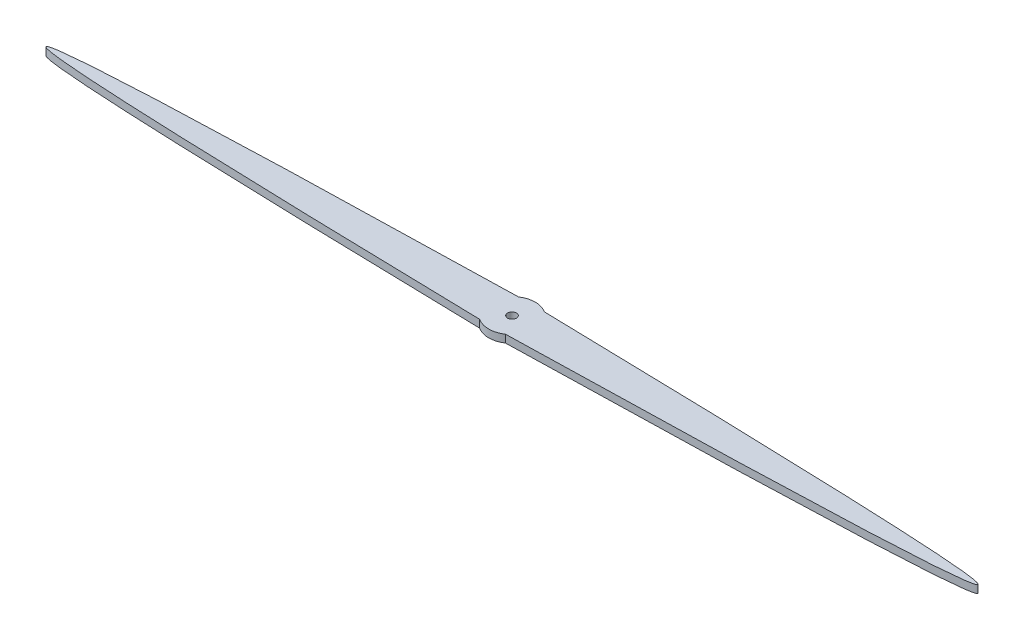
ISO-10303-21;
HEADER;
FILE_DESCRIPTION(('STEP AP214'),'2;1');
FILE_NAME('part.step','',(''),(''),'','','');
FILE_SCHEMA(('AUTOMOTIVE_DESIGN { 1 0 10303 214 1 1 1 1 }'));
ENDSEC;
DATA;
#1=APPLICATION_CONTEXT('core data for automotive mechanical design processes');
#2=APPLICATION_PROTOCOL_DEFINITION('international standard','automotive_design',2000,#1);
#3=PRODUCT_CONTEXT('',#1,'mechanical');
#4=PRODUCT('Part','Part','',(#3));
#5=PRODUCT_RELATED_PRODUCT_CATEGORY('part','',(#4));
#6=PRODUCT_DEFINITION_FORMATION('','',#4);
#7=PRODUCT_DEFINITION_CONTEXT('part definition',#1,'design');
#8=PRODUCT_DEFINITION('design','',#6,#7);
#9=PRODUCT_DEFINITION_SHAPE('','',#8);
#10=(LENGTH_UNIT() NAMED_UNIT(*) SI_UNIT(.MILLI.,.METRE.));
#11=(NAMED_UNIT(*) PLANE_ANGLE_UNIT() SI_UNIT($,.RADIAN.));
#12=(NAMED_UNIT(*) SI_UNIT($,.STERADIAN.) SOLID_ANGLE_UNIT());
#13=UNCERTAINTY_MEASURE_WITH_UNIT(LENGTH_MEASURE(1.E-05),#10,'distance_accuracy_value','');
#14=(GEOMETRIC_REPRESENTATION_CONTEXT(3) GLOBAL_UNCERTAINTY_ASSIGNED_CONTEXT((#13)) GLOBAL_UNIT_ASSIGNED_CONTEXT((#10,
#11,#12)) REPRESENTATION_CONTEXT('',''));
#15=CARTESIAN_POINT('',(0.,0.,0.));
#16=DIRECTION('',(0.,0.,1.));
#17=DIRECTION('',(1.,0.,0.));
#18=AXIS2_PLACEMENT_3D('',#15,#16,#17);
#19=CARTESIAN_POINT('',(152.4,2.5146,0.));
#20=DIRECTION('',(0.,1.,0.));
#21=DIRECTION('',(0.,0.,1.));
#22=AXIS2_PLACEMENT_3D('',#19,#20,#21);
#23=PLANE('',#22);
#24=CARTESIAN_POINT('',(4.21211348375136,2.5146,6.35));
#25=CARTESIAN_POINT('',(300.587886516249,2.5146,0.));
#26=CARTESIAN_POINT('',(4.21211348375136,2.5146,-6.35));
#27=B_SPLINE_CURVE_WITH_KNOTS('',2,(#24,#25,#26),.UNSPECIFIED.,.F.,.F.,(3,3),(0.,1.),.UNSPECIFIED.);
#28=CARTESIAN_POINT('',(4.21211348375136,2.5146,6.35));
#29=VERTEX_POINT('',#28);
#30=CARTESIAN_POINT('',(4.21211348375136,2.5146,-6.35));
#31=VERTEX_POINT('',#30);
#32=EDGE_CURVE('E91',#29,#31,#27,.T.);
#33=ORIENTED_EDGE('',*,*,#32,.T.);
#34=CARTESIAN_POINT('',(0.,2.5146,0.));
#35=DIRECTION('',(0.,1.,0.));
#36=DIRECTION('',(0.,0.,1.));
#37=AXIS2_PLACEMENT_3D('',#34,#35,#36);
#38=CIRCLE('',#37,7.62);
#39=CARTESIAN_POINT('',(-4.21211348375135,2.5146,-6.35));
#40=VERTEX_POINT('',#39);
#41=EDGE_CURVE('E86',#31,#40,#38,.T.);
#42=ORIENTED_EDGE('',*,*,#41,.T.);
#43=CARTESIAN_POINT('',(-4.21211348375136,2.5146,-6.35));
#44=CARTESIAN_POINT('',(-300.587886516249,2.5146,0.));
#45=CARTESIAN_POINT('',(-4.21211348375136,2.5146,6.35));
#46=B_SPLINE_CURVE_WITH_KNOTS('',2,(#43,#44,#45),.UNSPECIFIED.,.F.,.F.,(3,3),(0.,1.),.UNSPECIFIED.);
#47=CARTESIAN_POINT('',(-4.21211348375136,2.5146,6.35));
#48=VERTEX_POINT('',#47);
#49=EDGE_CURVE('E89',#40,#48,#46,.T.);
#50=ORIENTED_EDGE('',*,*,#49,.T.);
#51=CARTESIAN_POINT('',(0.,2.5146,0.));
#52=DIRECTION('',(0.,1.,0.));
#53=DIRECTION('',(0.,0.,1.));
#54=AXIS2_PLACEMENT_3D('',#51,#52,#53);
#55=CIRCLE('',#54,7.62);
#56=EDGE_CURVE('E56',#48,#29,#55,.T.);
#57=ORIENTED_EDGE('',*,*,#56,.T.);
#58=EDGE_LOOP('',(#33,#42,#50,#57));
#59=FACE_BOUND('',#58,.T.);
#60=CARTESIAN_POINT('',(0.,2.5146,0.));
#61=DIRECTION('',(0.,1.,0.));
#62=DIRECTION('',(0.,0.,1.));
#63=AXIS2_PLACEMENT_3D('',#60,#61,#62);
#64=CIRCLE('',#63,1.46304);
#65=CARTESIAN_POINT('',(0.,2.5146,1.46304));
#66=VERTEX_POINT('',#65);
#67=EDGE_CURVE('E135',#66,#66,#64,.T.);
#68=ORIENTED_EDGE('',*,*,#67,.F.);
#69=EDGE_LOOP('',(#68));
#70=FACE_BOUND('',#69,.T.);
#71=ADVANCED_FACE('F38',(#59,#70),#23,.T.);
#72=CARTESIAN_POINT('',(152.4,0.,0.));
#73=DIRECTION('',(0.,1.,0.));
#74=DIRECTION('',(0.,0.,1.));
#75=AXIS2_PLACEMENT_3D('',#72,#73,#74);
#76=PLANE('',#75);
#77=CARTESIAN_POINT('',(4.21211348375136,0.,6.35));
#78=CARTESIAN_POINT('',(300.587886516249,0.,0.));
#79=CARTESIAN_POINT('',(4.21211348375136,0.,-6.35));
#80=B_SPLINE_CURVE_WITH_KNOTS('',2,(#77,#78,#79),.UNSPECIFIED.,.F.,.F.,(3,3),(0.,1.),.UNSPECIFIED.);
#81=CARTESIAN_POINT('',(4.21211348375136,0.,6.35));
#82=VERTEX_POINT('',#81);
#83=CARTESIAN_POINT('',(4.21211348375136,0.,-6.35));
#84=VERTEX_POINT('',#83);
#85=EDGE_CURVE('E141',#82,#84,#80,.T.);
#86=ORIENTED_EDGE('',*,*,#85,.F.);
#87=CARTESIAN_POINT('',(0.,0.,0.));
#88=DIRECTION('',(0.,1.,0.));
#89=DIRECTION('',(0.,0.,1.));
#90=AXIS2_PLACEMENT_3D('',#87,#88,#89);
#91=CIRCLE('',#90,7.62);
#92=CARTESIAN_POINT('',(-4.21211348375136,0.,6.35));
#93=VERTEX_POINT('',#92);
#94=EDGE_CURVE('E79',#93,#82,#91,.T.);
#95=ORIENTED_EDGE('',*,*,#94,.F.);
#96=CARTESIAN_POINT('',(-4.21211348375136,0.,-6.35));
#97=CARTESIAN_POINT('',(-300.587886516249,0.,0.));
#98=CARTESIAN_POINT('',(-4.21211348375136,0.,6.35));
#99=B_SPLINE_CURVE_WITH_KNOTS('',2,(#96,#97,#98),.UNSPECIFIED.,.F.,.F.,(3,3),(0.,1.),.UNSPECIFIED.);
#100=CARTESIAN_POINT('',(-4.21211348375135,0.,-6.35));
#101=VERTEX_POINT('',#100);
#102=EDGE_CURVE('E73',#101,#93,#99,.T.);
#103=ORIENTED_EDGE('',*,*,#102,.F.);
#104=CARTESIAN_POINT('',(0.,0.,0.));
#105=DIRECTION('',(0.,1.,0.));
#106=DIRECTION('',(0.,0.,1.));
#107=AXIS2_PLACEMENT_3D('',#104,#105,#106);
#108=CIRCLE('',#107,7.62);
#109=EDGE_CURVE('E95',#84,#101,#108,.T.);
#110=ORIENTED_EDGE('',*,*,#109,.F.);
#111=EDGE_LOOP('',(#86,#95,#103,#110));
#112=FACE_BOUND('',#111,.T.);
#113=CARTESIAN_POINT('',(0.,0.,0.));
#114=DIRECTION('',(0.,1.,0.));
#115=DIRECTION('',(0.,0.,1.));
#116=AXIS2_PLACEMENT_3D('',#113,#114,#115);
#117=CIRCLE('',#116,1.46304);
#118=CARTESIAN_POINT('',(0.,0.,1.46304));
#119=VERTEX_POINT('',#118);
#120=EDGE_CURVE('E138',#119,#119,#117,.T.);
#121=ORIENTED_EDGE('',*,*,#120,.T.);
#122=EDGE_LOOP('',(#121));
#123=FACE_BOUND('',#122,.T.);
#124=ADVANCED_FACE('F117',(#112,#123),#76,.F.);
#125=DIRECTION('',(0.,-1.,0.));
#126=VECTOR('',#125,1.);
#127=SURFACE_OF_LINEAR_EXTRUSION('',#27,#126);
#128=ORIENTED_EDGE('',*,*,#85,.T.);
#129=DIRECTION('',(0.,-1.,0.));
#130=VECTOR('',#129,1.);
#131=CARTESIAN_POINT('',(4.21211348375136,2.5146,-6.35));
#132=LINE('',#131,#130);
#133=EDGE_CURVE('E11',#31,#84,#132,.T.);
#134=ORIENTED_EDGE('',*,*,#133,.F.);
#135=ORIENTED_EDGE('',*,*,#32,.F.);
#136=DIRECTION('',(0.,-1.,0.));
#137=VECTOR('',#136,1.);
#138=CARTESIAN_POINT('',(4.21211348375136,2.5146,6.35));
#139=LINE('',#138,#137);
#140=EDGE_CURVE('E99',#29,#82,#139,.T.);
#141=ORIENTED_EDGE('',*,*,#140,.T.);
#142=EDGE_LOOP('',(#128,#134,#135,#141));
#143=FACE_BOUND('',#142,.T.);
#144=ADVANCED_FACE('F40',(#143),#127,.F.);
#145=CARTESIAN_POINT('',(0.,2.5146,0.));
#146=DIRECTION('',(0.,-1.,0.));
#147=DIRECTION('',(0.,0.,-1.));
#148=AXIS2_PLACEMENT_3D('',#145,#146,#147);
#149=CYLINDRICAL_SURFACE('',#148,7.62);
#150=ORIENTED_EDGE('',*,*,#109,.T.);
#151=DIRECTION('',(0.,-1.,0.));
#152=VECTOR('',#151,1.);
#153=CARTESIAN_POINT('',(-4.21211348375135,2.5146,-6.35));
#154=LINE('',#153,#152);
#155=EDGE_CURVE('E48',#40,#101,#154,.T.);
#156=ORIENTED_EDGE('',*,*,#155,.F.);
#157=ORIENTED_EDGE('',*,*,#41,.F.);
#158=ORIENTED_EDGE('',*,*,#133,.T.);
#159=EDGE_LOOP('',(#150,#156,#157,#158));
#160=FACE_BOUND('',#159,.T.);
#161=ADVANCED_FACE('F94',(#160),#149,.T.);
#162=DIRECTION('',(0.,-1.,0.));
#163=VECTOR('',#162,1.);
#164=SURFACE_OF_LINEAR_EXTRUSION('',#46,#163);
#165=ORIENTED_EDGE('',*,*,#102,.T.);
#166=DIRECTION('',(0.,-1.,0.));
#167=VECTOR('',#166,1.);
#168=CARTESIAN_POINT('',(-4.21211348375136,2.5146,6.35));
#169=LINE('',#168,#167);
#170=EDGE_CURVE('E96',#48,#93,#169,.T.);
#171=ORIENTED_EDGE('',*,*,#170,.F.);
#172=ORIENTED_EDGE('',*,*,#49,.F.);
#173=ORIENTED_EDGE('',*,*,#155,.T.);
#174=EDGE_LOOP('',(#165,#171,#172,#173));
#175=FACE_BOUND('',#174,.T.);
#176=ADVANCED_FACE('F97',(#175),#164,.F.);
#177=CARTESIAN_POINT('',(0.,2.5146,0.));
#178=DIRECTION('',(0.,-1.,0.));
#179=DIRECTION('',(0.,0.,-1.));
#180=AXIS2_PLACEMENT_3D('',#177,#178,#179);
#181=CYLINDRICAL_SURFACE('',#180,7.62);
#182=ORIENTED_EDGE('',*,*,#94,.T.);
#183=ORIENTED_EDGE('',*,*,#140,.F.);
#184=ORIENTED_EDGE('',*,*,#56,.F.);
#185=ORIENTED_EDGE('',*,*,#170,.T.);
#186=EDGE_LOOP('',(#182,#183,#184,#185));
#187=FACE_BOUND('',#186,.T.);
#188=ADVANCED_FACE('F111',(#187),#181,.T.);
#189=CARTESIAN_POINT('',(0.,2.5146,0.));
#190=DIRECTION('',(0.,-1.,0.));
#191=DIRECTION('',(0.,0.,-1.));
#192=AXIS2_PLACEMENT_3D('',#189,#190,#191);
#193=CYLINDRICAL_SURFACE('',#192,1.46304);
#194=ORIENTED_EDGE('',*,*,#67,.T.);
#195=EDGE_LOOP('',(#194));
#196=FACE_BOUND('',#195,.T.);
#197=ORIENTED_EDGE('',*,*,#120,.F.);
#198=EDGE_LOOP('',(#197));
#199=FACE_BOUND('',#198,.T.);
#200=ADVANCED_FACE('F126',(#196,#199),#193,.F.);
#201=CLOSED_SHELL('',(#71,#124,#144,#161,#176,#188,#200));
#202=MANIFOLD_SOLID_BREP('B2',#201);
#203=ADVANCED_BREP_SHAPE_REPRESENTATION('',(#18,#202),#14);
#204=SHAPE_DEFINITION_REPRESENTATION(#9,#203);
ENDSEC;
END-ISO-10303-21;
